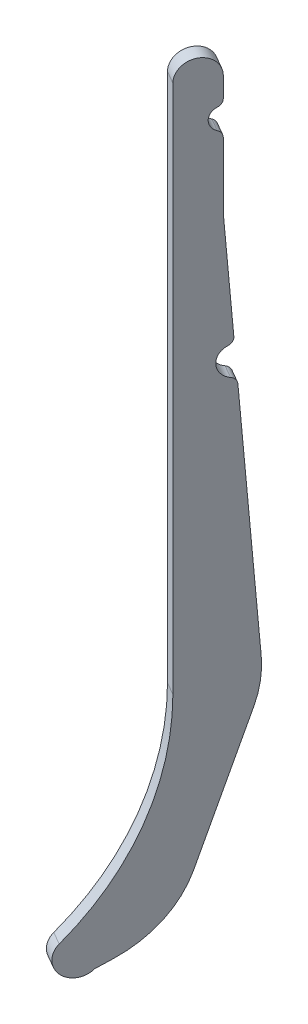
ISO-10303-21;
HEADER;
FILE_DESCRIPTION(('STEP AP214'),'2;1');
FILE_NAME('part.step','',(''),(''),'','','');
FILE_SCHEMA(('AUTOMOTIVE_DESIGN { 1 0 10303 214 1 1 1 1 }'));
ENDSEC;
DATA;
#1=APPLICATION_CONTEXT('core data for automotive mechanical design processes');
#2=APPLICATION_PROTOCOL_DEFINITION('international standard','automotive_design',2000,#1);
#3=PRODUCT_CONTEXT('',#1,'mechanical');
#4=PRODUCT('Part','Part','',(#3));
#5=PRODUCT_RELATED_PRODUCT_CATEGORY('part','',(#4));
#6=PRODUCT_DEFINITION_FORMATION('','',#4);
#7=PRODUCT_DEFINITION_CONTEXT('part definition',#1,'design');
#8=PRODUCT_DEFINITION('design','',#6,#7);
#9=PRODUCT_DEFINITION_SHAPE('','',#8);
#10=(LENGTH_UNIT() NAMED_UNIT(*) SI_UNIT(.MILLI.,.METRE.));
#11=(NAMED_UNIT(*) PLANE_ANGLE_UNIT() SI_UNIT($,.RADIAN.));
#12=(NAMED_UNIT(*) SI_UNIT($,.STERADIAN.) SOLID_ANGLE_UNIT());
#13=UNCERTAINTY_MEASURE_WITH_UNIT(LENGTH_MEASURE(1.E-05),#10,'distance_accuracy_value','');
#14=(GEOMETRIC_REPRESENTATION_CONTEXT(3) GLOBAL_UNCERTAINTY_ASSIGNED_CONTEXT((#13)) GLOBAL_UNIT_ASSIGNED_CONTEXT((#10,
#11,#12)) REPRESENTATION_CONTEXT('',''));
#15=CARTESIAN_POINT('',(0.,0.,0.));
#16=DIRECTION('',(0.,0.,1.));
#17=DIRECTION('',(1.,0.,0.));
#18=AXIS2_PLACEMENT_3D('',#15,#16,#17);
#19=CARTESIAN_POINT('',(-39.0363477362785,-207.116263928434,7.22466133764308));
#20=DIRECTION('',(0.866025403782537,0.,0.500000000003293));
#21=DIRECTION('',(0.500000000003293,0.,-0.866025403782537));
#22=AXIS2_PLACEMENT_3D('',#19,#20,#21);
#23=CYLINDRICAL_SURFACE('',#22,77.);
#24=CARTESIAN_POINT('',(-35.5722461211484,-207.116263928434,9.22466133765625));
#25=DIRECTION('',(-0.866025403782537,0.,-0.500000000003293));
#26=DIRECTION('',(-0.500000000003293,0.,0.866025403782537));
#27=AXIS2_PLACEMENT_3D('',#24,#25,#26);
#28=CIRCLE('',#27,77.);
#29=CARTESIAN_POINT('',(2.9277538791052,-207.116263928434,-57.4592947535991));
#30=VERTEX_POINT('',#29);
#31=CARTESIAN_POINT('',(-8.348635045287,-261.563486079798,-37.9280162108164));
#32=VERTEX_POINT('',#31);
#33=EDGE_CURVE('E192',#30,#32,#28,.T.);
#34=ORIENTED_EDGE('',*,*,#33,.F.);
#35=DIRECTION('',(0.866025403782537,0.,0.500000000003293));
#36=VECTOR('',#35,1.);
#37=CARTESIAN_POINT('',(-0.536347736024945,-207.116263928434,-59.4592947536123));
#38=LINE('',#37,#36);
#39=CARTESIAN_POINT('',(-0.536347736024945,-207.116263928434,-59.4592947536123));
#40=VERTEX_POINT('',#39);
#41=EDGE_CURVE('E11',#40,#30,#38,.T.);
#42=ORIENTED_EDGE('',*,*,#41,.F.);
#43=CARTESIAN_POINT('',(-39.0363477362785,-207.116263928434,7.22466133764308));
#44=DIRECTION('',(-0.866025403782537,0.,-0.500000000003293));
#45=DIRECTION('',(-0.500000000003293,0.,0.866025403782537));
#46=AXIS2_PLACEMENT_3D('',#43,#44,#45);
#47=CIRCLE('',#46,77.);
#48=CARTESIAN_POINT('',(-11.8127366604171,-261.563486079798,-39.9280162108296));
#49=VERTEX_POINT('',#48);
#50=EDGE_CURVE('E235',#40,#49,#47,.T.);
#51=ORIENTED_EDGE('',*,*,#50,.T.);
#52=DIRECTION('',(0.866025403782537,0.,0.500000000003293));
#53=VECTOR('',#52,1.);
#54=CARTESIAN_POINT('',(-11.8127366604171,-261.563486079798,-39.9280162108296));
#55=LINE('',#54,#53);
#56=EDGE_CURVE('E36',#49,#32,#55,.T.);
#57=ORIENTED_EDGE('',*,*,#56,.T.);
#58=EDGE_LOOP('',(#34,#42,#51,#57));
#59=FACE_BOUND('',#58,.T.);
#60=ADVANCED_FACE('F33',(#59),#23,.F.);
#61=CARTESIAN_POINT('',(-0.536347736024945,-207.116263928434,-59.4592947536123));
#62=DIRECTION('',(0.500000000003293,0.,-0.866025403782537));
#63=DIRECTION('',(-0.866025403782537,0.,-0.500000000003293));
#64=AXIS2_PLACEMENT_3D('',#61,#62,#63);
#65=PLANE('',#64);
#66=DIRECTION('',(0.,1.,0.));
#67=VECTOR('',#66,1.);
#68=CARTESIAN_POINT('',(2.9277538791052,-207.116263928434,-57.4592947535991));
#69=LINE('',#68,#67);
#70=CARTESIAN_POINT('',(2.9277538791052,-63.6684610881357,-57.4592947535991));
#71=VERTEX_POINT('',#70);
#72=EDGE_CURVE('E108',#30,#71,#69,.T.);
#73=ORIENTED_EDGE('',*,*,#72,.T.);
#74=DIRECTION('',(0.866025403782537,0.,0.500000000003293));
#75=VECTOR('',#74,1.);
#76=CARTESIAN_POINT('',(-0.536347736024945,-63.6684610881357,-59.4592947536123));
#77=LINE('',#76,#75);
#78=CARTESIAN_POINT('',(-0.536347736024945,-63.6684610881357,-59.4592947536123));
#79=VERTEX_POINT('',#78);
#80=EDGE_CURVE('E42',#79,#71,#77,.T.);
#81=ORIENTED_EDGE('',*,*,#80,.F.);
#82=DIRECTION('',(0.,1.,0.));
#83=VECTOR('',#82,1.);
#84=CARTESIAN_POINT('',(-0.536347736024945,-207.116263928434,-59.4592947536123));
#85=LINE('',#84,#83);
#86=EDGE_CURVE('E171',#40,#79,#85,.T.);
#87=ORIENTED_EDGE('',*,*,#86,.F.);
#88=ORIENTED_EDGE('',*,*,#41,.T.);
#89=EDGE_LOOP('',(#73,#81,#87,#88));
#90=FACE_BOUND('',#89,.T.);
#91=ADVANCED_FACE('F368',(#90),#65,.F.);
#92=CARTESIAN_POINT('',(1.96365226399152,-63.6684610881357,-63.789421772525));
#93=DIRECTION('',(0.866025403782537,0.,0.500000000003293));
#94=DIRECTION('',(0.500000000003293,0.,-0.866025403782537));
#95=AXIS2_PLACEMENT_3D('',#92,#93,#94);
#96=CYLINDRICAL_SURFACE('',#95,5.);
#97=CARTESIAN_POINT('',(5.42775387912167,-63.6684610881357,-61.7894217725118));
#98=DIRECTION('',(-0.866025403782537,0.,-0.500000000003293));
#99=DIRECTION('',(-0.500000000003293,0.,0.866025403782537));
#100=AXIS2_PLACEMENT_3D('',#97,#98,#99);
#101=CIRCLE('',#100,5.);
#102=CARTESIAN_POINT('',(7.92775387913814,-63.6684610881357,-66.1195487914245));
#103=VERTEX_POINT('',#102);
#104=EDGE_CURVE('E178',#71,#103,#101,.T.);
#105=ORIENTED_EDGE('',*,*,#104,.T.);
#106=DIRECTION('',(0.866025403782537,0.,0.500000000003293));
#107=VECTOR('',#106,1.);
#108=CARTESIAN_POINT('',(4.46365226400799,-63.6684610881357,-68.1195487914377));
#109=LINE('',#108,#107);
#110=CARTESIAN_POINT('',(4.46365226400799,-63.6684610881357,-68.1195487914377));
#111=VERTEX_POINT('',#110);
#112=EDGE_CURVE('E175',#111,#103,#109,.T.);
#113=ORIENTED_EDGE('',*,*,#112,.F.);
#114=CARTESIAN_POINT('',(1.96365226399152,-63.6684610881357,-63.789421772525));
#115=DIRECTION('',(-0.866025403782537,0.,-0.500000000003293));
#116=DIRECTION('',(-0.500000000003293,0.,0.866025403782537));
#117=AXIS2_PLACEMENT_3D('',#114,#115,#116);
#118=CIRCLE('',#117,5.);
#119=EDGE_CURVE('E163',#79,#111,#118,.T.);
#120=ORIENTED_EDGE('',*,*,#119,.F.);
#121=ORIENTED_EDGE('',*,*,#80,.T.);
#122=EDGE_LOOP('',(#105,#113,#120,#121));
#123=FACE_BOUND('',#122,.T.);
#124=ADVANCED_FACE('F176',(#123),#96,.T.);
#125=CARTESIAN_POINT('',(4.46365226400799,-69.0858853931799,-68.1195487914377));
#126=DIRECTION('',(0.500000000003293,0.,-0.866025403782537));
#127=DIRECTION('',(-0.866025403782537,0.,-0.500000000003293));
#128=AXIS2_PLACEMENT_3D('',#125,#126,#127);
#129=PLANE('',#128);
#130=DIRECTION('',(0.,1.,0.));
#131=VECTOR('',#130,1.);
#132=CARTESIAN_POINT('',(7.92775387913814,-69.0858853931799,-66.1195487914245));
#133=LINE('',#132,#131);
#134=CARTESIAN_POINT('',(7.92775387913814,-69.0858853931799,-66.1195487914245));
#135=VERTEX_POINT('',#134);
#136=EDGE_CURVE('E232',#135,#103,#133,.T.);
#137=ORIENTED_EDGE('',*,*,#136,.F.);
#138=DIRECTION('',(0.866025403782537,0.,0.500000000003293));
#139=VECTOR('',#138,1.);
#140=CARTESIAN_POINT('',(4.46365226400799,-69.0858853931799,-68.1195487914377));
#141=LINE('',#140,#139);
#142=CARTESIAN_POINT('',(4.46365226400799,-69.0858853931799,-68.1195487914377));
#143=VERTEX_POINT('',#142);
#144=EDGE_CURVE('E182',#143,#135,#141,.T.);
#145=ORIENTED_EDGE('',*,*,#144,.F.);
#146=DIRECTION('',(0.,1.,0.));
#147=VECTOR('',#146,1.);
#148=CARTESIAN_POINT('',(4.46365226400799,-69.0858853931799,-68.1195487914377));
#149=LINE('',#148,#147);
#150=EDGE_CURVE('E169',#143,#111,#149,.T.);
#151=ORIENTED_EDGE('',*,*,#150,.T.);
#152=ORIENTED_EDGE('',*,*,#112,.T.);
#153=EDGE_LOOP('',(#137,#145,#151,#152));
#154=FACE_BOUND('',#153,.T.);
#155=ADVANCED_FACE('F184',(#154),#129,.T.);
#156=CARTESIAN_POINT('',(3.46365226400139,-69.0858853931799,-66.3874979838726));
#157=DIRECTION('',(0.866025403782537,0.,0.500000000003293));
#158=DIRECTION('',(0.500000000003293,0.,-0.866025403782537));
#159=AXIS2_PLACEMENT_3D('',#156,#157,#158);
#160=CYLINDRICAL_SURFACE('',#159,2.);
#161=CARTESIAN_POINT('',(6.92775387913154,-69.0858853931799,-64.3874979838594));
#162=DIRECTION('',(0.866025403782537,0.,0.500000000003293));
#163=DIRECTION('',(0.500000000003293,0.,-0.866025403782537));
#164=AXIS2_PLACEMENT_3D('',#161,#162,#163);
#165=CIRCLE('',#164,2.);
#166=CARTESIAN_POINT('',(7.32775387913418,-70.9189156711622,-65.0803183068855));
#167=VERTEX_POINT('',#166);
#168=EDGE_CURVE('E229',#167,#135,#165,.T.);
#169=ORIENTED_EDGE('',*,*,#168,.F.);
#170=DIRECTION('',(0.866025403782537,0.,0.500000000003293));
#171=VECTOR('',#170,1.);
#172=CARTESIAN_POINT('',(3.86365226400403,-70.9189156711622,-67.0803183068986));
#173=LINE('',#172,#171);
#174=CARTESIAN_POINT('',(3.86365226400403,-70.9189156711622,-67.0803183068986));
#175=VERTEX_POINT('',#174);
#176=EDGE_CURVE('E239',#175,#167,#173,.T.);
#177=ORIENTED_EDGE('',*,*,#176,.F.);
#178=CARTESIAN_POINT('',(3.46365226400139,-69.0858853931799,-66.3874979838726));
#179=DIRECTION('',(0.866025403782537,0.,0.500000000003293));
#180=DIRECTION('',(0.500000000003293,0.,-0.866025403782537));
#181=AXIS2_PLACEMENT_3D('',#178,#179,#180);
#182=CIRCLE('',#181,2.);
#183=EDGE_CURVE('E185',#175,#143,#182,.T.);
#184=ORIENTED_EDGE('',*,*,#183,.T.);
#185=ORIENTED_EDGE('',*,*,#144,.T.);
#186=EDGE_LOOP('',(#169,#177,#184,#185));
#187=FACE_BOUND('',#186,.T.);
#188=ADVANCED_FACE('F277',(#187),#160,.T.);
#189=CARTESIAN_POINT('',(4.46365226400798,-73.6684610881357,-68.1195487914377));
#190=DIRECTION('',(0.866025403782537,0.,0.500000000003293));
#191=DIRECTION('',(0.500000000003293,0.,-0.866025403782537));
#192=AXIS2_PLACEMENT_3D('',#189,#190,#191);
#193=CYLINDRICAL_SURFACE('',#192,3.);
#194=CARTESIAN_POINT('',(7.92775387913813,-73.6684610881357,-66.1195487914245));
#195=DIRECTION('',(-0.866025403782537,0.,-0.500000000003293));
#196=DIRECTION('',(-0.500000000003293,0.,0.866025403782537));
#197=AXIS2_PLACEMENT_3D('',#194,#195,#196);
#198=CIRCLE('',#197,3.);
#199=CARTESIAN_POINT('',(7.32775387913418,-76.4180065051092,-65.0803183068855));
#200=VERTEX_POINT('',#199);
#201=EDGE_CURVE('E226',#200,#167,#198,.T.);
#202=ORIENTED_EDGE('',*,*,#201,.F.);
#203=DIRECTION('',(0.866025403782537,0.,0.500000000003293));
#204=VECTOR('',#203,1.);
#205=CARTESIAN_POINT('',(3.86365226400403,-76.4180065051092,-67.0803183068986));
#206=LINE('',#205,#204);
#207=CARTESIAN_POINT('',(3.86365226400403,-76.4180065051092,-67.0803183068986));
#208=VERTEX_POINT('',#207);
#209=EDGE_CURVE('E241',#208,#200,#206,.T.);
#210=ORIENTED_EDGE('',*,*,#209,.F.);
#211=CARTESIAN_POINT('',(4.46365226400798,-73.6684610881357,-68.1195487914377));
#212=DIRECTION('',(-0.866025403782537,0.,-0.500000000003293));
#213=DIRECTION('',(-0.500000000003293,0.,0.866025403782537));
#214=AXIS2_PLACEMENT_3D('',#211,#212,#213);
#215=CIRCLE('',#214,3.);
#216=EDGE_CURVE('E187',#208,#175,#215,.T.);
#217=ORIENTED_EDGE('',*,*,#216,.T.);
#218=ORIENTED_EDGE('',*,*,#176,.T.);
#219=EDGE_LOOP('',(#202,#210,#217,#218));
#220=FACE_BOUND('',#219,.T.);
#221=ADVANCED_FACE('F281',(#220),#193,.F.);
#222=CARTESIAN_POINT('',(3.46365226400139,-78.2510367830915,-66.3874979838726));
#223=DIRECTION('',(0.866025403782537,0.,0.500000000003293));
#224=DIRECTION('',(0.500000000003293,0.,-0.866025403782537));
#225=AXIS2_PLACEMENT_3D('',#222,#223,#224);
#226=CYLINDRICAL_SURFACE('',#225,2.);
#227=CARTESIAN_POINT('',(6.92775387913154,-78.2510367830915,-64.3874979838594));
#228=DIRECTION('',(-0.866025403782537,0.,-0.500000000003293));
#229=DIRECTION('',(-0.500000000003293,0.,0.866025403782537));
#230=AXIS2_PLACEMENT_3D('',#227,#228,#229);
#231=CIRCLE('',#230,2.);
#232=CARTESIAN_POINT('',(7.92775387913813,-78.2510367830915,-66.1195487914245));
#233=VERTEX_POINT('',#232);
#234=EDGE_CURVE('E223',#200,#233,#231,.T.);
#235=ORIENTED_EDGE('',*,*,#234,.T.);
#236=DIRECTION('',(0.866025403782537,0.,0.500000000003293));
#237=VECTOR('',#236,1.);
#238=CARTESIAN_POINT('',(4.46365226400798,-78.2510367830915,-68.1195487914377));
#239=LINE('',#238,#237);
#240=CARTESIAN_POINT('',(4.46365226400798,-78.2510367830915,-68.1195487914377));
#241=VERTEX_POINT('',#240);
#242=EDGE_CURVE('E243',#241,#233,#239,.T.);
#243=ORIENTED_EDGE('',*,*,#242,.F.);
#244=CARTESIAN_POINT('',(3.46365226400139,-78.2510367830915,-66.3874979838726));
#245=DIRECTION('',(-0.866025403782537,0.,-0.500000000003293));
#246=DIRECTION('',(-0.500000000003293,0.,0.866025403782537));
#247=AXIS2_PLACEMENT_3D('',#244,#245,#246);
#248=CIRCLE('',#247,2.);
#249=EDGE_CURVE('E283',#208,#241,#248,.T.);
#250=ORIENTED_EDGE('',*,*,#249,.F.);
#251=ORIENTED_EDGE('',*,*,#209,.T.);
#252=EDGE_LOOP('',(#235,#243,#250,#251));
#253=FACE_BOUND('',#252,.T.);
#254=ADVANCED_FACE('F358',(#253),#226,.T.);
#255=CARTESIAN_POINT('',(4.46365226400799,-96.0501889482241,-68.1195487914377));
#256=DIRECTION('',(0.500000000003293,0.,-0.866025403782537));
#257=DIRECTION('',(-0.866025403782537,0.,-0.500000000003293));
#258=AXIS2_PLACEMENT_3D('',#255,#256,#257);
#259=PLANE('',#258);
#260=DIRECTION('',(0.,1.,0.));
#261=VECTOR('',#260,1.);
#262=CARTESIAN_POINT('',(7.92775387913814,-96.0501889482241,-66.1195487914245));
#263=LINE('',#262,#261);
#264=CARTESIAN_POINT('',(7.92775387913814,-96.0501889482241,-66.1195487914245));
#265=VERTEX_POINT('',#264);
#266=EDGE_CURVE('E220',#265,#233,#263,.T.);
#267=ORIENTED_EDGE('',*,*,#266,.F.);
#268=DIRECTION('',(0.866025403782537,0.,0.500000000003293));
#269=VECTOR('',#268,1.);
#270=CARTESIAN_POINT('',(4.46365226400799,-96.0501889482241,-68.1195487914377));
#271=LINE('',#270,#269);
#272=CARTESIAN_POINT('',(4.46365226400799,-96.0501889482241,-68.1195487914377));
#273=VERTEX_POINT('',#272);
#274=EDGE_CURVE('E245',#273,#265,#271,.T.);
#275=ORIENTED_EDGE('',*,*,#274,.F.);
#276=DIRECTION('',(0.,1.,0.));
#277=VECTOR('',#276,1.);
#278=CARTESIAN_POINT('',(4.46365226400799,-96.0501889482241,-68.1195487914377));
#279=LINE('',#278,#277);
#280=EDGE_CURVE('E284',#273,#241,#279,.T.);
#281=ORIENTED_EDGE('',*,*,#280,.T.);
#282=ORIENTED_EDGE('',*,*,#242,.T.);
#283=EDGE_LOOP('',(#267,#275,#281,#282));
#284=FACE_BOUND('',#283,.T.);
#285=ADVANCED_FACE('F355',(#284),#259,.T.);
#286=CARTESIAN_POINT('',(4.46365226400799,-96.0501889482241,-68.1195487914377));
#287=DIRECTION('',(-0.498726456811667,-0.0713280107491375,0.863819562269026));
#288=DIRECTION('',(0.866025403782537,0.,0.500000000003293));
#289=AXIS2_PLACEMENT_3D('',#286,#287,#288);
#290=PLANE('',#289);
#291=DIRECTION('',(0.0356640053748036,-0.997452913616764,-0.061771869310027));
#292=VECTOR('',#291,1.);
#293=CARTESIAN_POINT('',(7.92775387913814,-96.0501889482241,-66.1195487914245));
#294=LINE('',#293,#292);
#295=CARTESIAN_POINT('',(8.97424798689789,-125.318595171749,-67.9321297558699));
#296=VERTEX_POINT('',#295);
#297=EDGE_CURVE('E217',#265,#296,#294,.T.);
#298=ORIENTED_EDGE('',*,*,#297,.T.);
#299=DIRECTION('',(0.866025403782537,0.,0.500000000003293));
#300=VECTOR('',#299,1.);
#301=CARTESIAN_POINT('',(5.51014637176774,-125.318595171749,-69.9321297558831));
#302=LINE('',#301,#300);
#303=CARTESIAN_POINT('',(5.51014637176774,-125.318595171749,-69.9321297558831));
#304=VERTEX_POINT('',#303);
#305=EDGE_CURVE('E247',#304,#296,#302,.T.);
#306=ORIENTED_EDGE('',*,*,#305,.F.);
#307=DIRECTION('',(0.0356640053748036,-0.997452913616764,-0.061771869310027));
#308=VECTOR('',#307,1.);
#309=CARTESIAN_POINT('',(4.46365226400799,-96.0501889482241,-68.1195487914377));
#310=LINE('',#309,#308);
#311=EDGE_CURVE('E289',#273,#304,#310,.T.);
#312=ORIENTED_EDGE('',*,*,#311,.F.);
#313=ORIENTED_EDGE('',*,*,#274,.T.);
#314=EDGE_LOOP('',(#298,#306,#312,#313));
#315=FACE_BOUND('',#314,.T.);
#316=ADVANCED_FACE('F352',(#315),#290,.F.);
#317=CARTESIAN_POINT('',(4.51269345814441,-125.461251193248,-68.2044906313451));
#318=DIRECTION('',(0.866025403782537,0.,0.500000000003293));
#319=DIRECTION('',(0.500000000003293,0.,-0.866025403782537));
#320=AXIS2_PLACEMENT_3D('',#317,#318,#319);
#321=CYLINDRICAL_SURFACE('',#320,2.);
#322=CARTESIAN_POINT('',(7.97679507327455,-125.461251193248,-66.2044906313319));
#323=DIRECTION('',(0.866025403782537,0.,0.500000000003293));
#324=DIRECTION('',(0.500000000003293,0.,-0.866025403782537));
#325=AXIS2_PLACEMENT_3D('',#322,#323,#324);
#326=CIRCLE('',#325,2.);
#327=CARTESIAN_POINT('',(8.37652807126847,-127.294514437102,-66.8968484933131));
#328=VERTEX_POINT('',#327);
#329=EDGE_CURVE('E214',#328,#296,#326,.T.);
#330=ORIENTED_EDGE('',*,*,#329,.F.);
#331=DIRECTION('',(0.866025403782537,0.,0.500000000003293));
#332=VECTOR('',#331,1.);
#333=CARTESIAN_POINT('',(4.91242645613832,-127.294514437102,-68.8968484933262));
#334=LINE('',#333,#332);
#335=CARTESIAN_POINT('',(4.91242645613832,-127.294514437102,-68.8968484933262));
#336=VERTEX_POINT('',#335);
#337=EDGE_CURVE('E249',#336,#328,#334,.T.);
#338=ORIENTED_EDGE('',*,*,#337,.F.);
#339=CARTESIAN_POINT('',(4.51269345814441,-125.461251193248,-68.2044906313451));
#340=DIRECTION('',(0.866025403782537,0.,0.500000000003293));
#341=DIRECTION('',(0.500000000003293,0.,-0.866025403782537));
#342=AXIS2_PLACEMENT_3D('',#339,#340,#341);
#343=CIRCLE('',#342,2.);
#344=EDGE_CURVE('E291',#336,#304,#343,.T.);
#345=ORIENTED_EDGE('',*,*,#344,.T.);
#346=ORIENTED_EDGE('',*,*,#305,.T.);
#347=EDGE_LOOP('',(#330,#338,#345,#346));
#348=FACE_BOUND('',#347,.T.);
#349=ADVANCED_FACE('F347',(#348),#321,.T.);
#350=CARTESIAN_POINT('',(5.71189245212612,-130.961040924811,-70.2815642172886));
#351=DIRECTION('',(0.866025403782537,0.,0.500000000003293));
#352=DIRECTION('',(0.500000000003293,0.,-0.866025403782537));
#353=AXIS2_PLACEMENT_3D('',#350,#351,#352);
#354=CYLINDRICAL_SURFACE('',#353,4.);
#355=CARTESIAN_POINT('',(9.17599406725627,-130.961040924811,-68.2815642172755));
#356=DIRECTION('',(-0.866025403782537,0.,-0.500000000003293));
#357=DIRECTION('',(-0.500000000003293,0.,0.866025403782537));
#358=AXIS2_PLACEMENT_3D('',#355,#356,#357);
#359=CIRCLE('',#358,4.);
#360=CARTESIAN_POINT('',(8.64552284507961,-134.817775441184,-67.3627611085204));
#361=VERTEX_POINT('',#360);
#362=EDGE_CURVE('E211',#361,#328,#359,.T.);
#363=ORIENTED_EDGE('',*,*,#362,.F.);
#364=DIRECTION('',(0.866025403782537,0.,0.500000000003293));
#365=VECTOR('',#364,1.);
#366=CARTESIAN_POINT('',(5.18142122994947,-134.817775441184,-69.3627611085336));
#367=LINE('',#366,#365);
#368=CARTESIAN_POINT('',(5.18142122994947,-134.817775441184,-69.3627611085336));
#369=VERTEX_POINT('',#368);
#370=EDGE_CURVE('E251',#369,#361,#367,.T.);
#371=ORIENTED_EDGE('',*,*,#370,.F.);
#372=CARTESIAN_POINT('',(5.71189245212612,-130.961040924811,-70.2815642172886));
#373=DIRECTION('',(-0.866025403782537,0.,-0.500000000003293));
#374=DIRECTION('',(-0.500000000003293,0.,0.866025403782537));
#375=AXIS2_PLACEMENT_3D('',#372,#373,#374);
#376=CIRCLE('',#375,4.);
#377=EDGE_CURVE('E294',#369,#336,#376,.T.);
#378=ORIENTED_EDGE('',*,*,#377,.T.);
#379=ORIENTED_EDGE('',*,*,#337,.T.);
#380=EDGE_LOOP('',(#363,#371,#378,#379));
#381=FACE_BOUND('',#380,.T.);
#382=ADVANCED_FACE('F342',(#381),#354,.F.);
#383=CARTESIAN_POINT('',(4.91618561886116,-136.746142699371,-68.9033595541561));
#384=DIRECTION('',(0.866025403782537,0.,0.500000000003293));
#385=DIRECTION('',(0.500000000003293,0.,-0.866025403782537));
#386=AXIS2_PLACEMENT_3D('',#383,#384,#385);
#387=CYLINDRICAL_SURFACE('',#386,2.);
#388=CARTESIAN_POINT('',(8.38028723399131,-136.746142699371,-66.9033595541429));
#389=DIRECTION('',(-0.866025403782537,0.,-0.500000000003293));
#390=DIRECTION('',(-0.500000000003293,0.,0.866025403782537));
#391=AXIS2_PLACEMENT_3D('',#388,#389,#390);
#392=CIRCLE('',#391,2.);
#393=CARTESIAN_POINT('',(9.37774014761464,-136.603486677872,-68.630998678681));
#394=VERTEX_POINT('',#393);
#395=EDGE_CURVE('E209',#361,#394,#392,.T.);
#396=ORIENTED_EDGE('',*,*,#395,.T.);
#397=DIRECTION('',(0.866025403782537,0.,0.500000000003293));
#398=VECTOR('',#397,1.);
#399=CARTESIAN_POINT('',(5.91363853248449,-136.603486677872,-70.6309986786941));
#400=LINE('',#399,#398);
#401=CARTESIAN_POINT('',(5.91363853248449,-136.603486677872,-70.6309986786941));
#402=VERTEX_POINT('',#401);
#403=EDGE_CURVE('E253',#402,#394,#400,.T.);
#404=ORIENTED_EDGE('',*,*,#403,.F.);
#405=CARTESIAN_POINT('',(4.91618561886116,-136.746142699371,-68.9033595541561));
#406=DIRECTION('',(-0.866025403782537,0.,-0.500000000003293));
#407=DIRECTION('',(-0.500000000003293,0.,0.866025403782537));
#408=AXIS2_PLACEMENT_3D('',#405,#406,#407);
#409=CIRCLE('',#408,2.);
#410=EDGE_CURVE('E297',#369,#402,#409,.T.);
#411=ORIENTED_EDGE('',*,*,#410,.F.);
#412=ORIENTED_EDGE('',*,*,#370,.T.);
#413=EDGE_LOOP('',(#396,#404,#411,#412));
#414=FACE_BOUND('',#413,.T.);
#415=ADVANCED_FACE('F339',(#414),#387,.T.);
#416=CARTESIAN_POINT('',(5.91363853248449,-136.603486677872,-70.6309986786941));
#417=DIRECTION('',(-0.498726456811667,-0.0713280107491381,0.863819562269026));
#418=DIRECTION('',(0.866025403782537,0.,0.500000000003293));
#419=AXIS2_PLACEMENT_3D('',#416,#417,#418);
#420=PLANE('',#419);
#421=DIRECTION('',(0.035664005374804,-0.997452913616763,-0.0617718693100274));
#422=VECTOR('',#421,1.);
#423=CARTESIAN_POINT('',(9.37774014761464,-136.603486677872,-68.630998678681));
#424=LINE('',#423,#422);
#425=CARTESIAN_POINT('',(11.6877667870702,-201.210442005586,-72.6320821850205));
#426=VERTEX_POINT('',#425);
#427=EDGE_CURVE('E207',#394,#426,#424,.T.);
#428=ORIENTED_EDGE('',*,*,#427,.T.);
#429=DIRECTION('',(0.866025403782537,0.,0.500000000003293));
#430=VECTOR('',#429,1.);
#431=CARTESIAN_POINT('',(8.22366517194008,-201.210442005586,-74.6320821850337));
#432=LINE('',#431,#430);
#433=CARTESIAN_POINT('',(8.22366517194008,-201.210442005586,-74.6320821850337));
#434=VERTEX_POINT('',#433);
#435=EDGE_CURVE('E256',#434,#426,#432,.T.);
#436=ORIENTED_EDGE('',*,*,#435,.F.);
#437=DIRECTION('',(0.035664005374804,-0.997452913616763,-0.0617718693100274));
#438=VECTOR('',#437,1.);
#439=CARTESIAN_POINT('',(5.91363853248449,-136.603486677872,-70.6309986786941));
#440=LINE('',#439,#438);
#441=EDGE_CURVE('E299',#402,#434,#440,.T.);
#442=ORIENTED_EDGE('',*,*,#441,.F.);
#443=ORIENTED_EDGE('',*,*,#403,.T.);
#444=EDGE_LOOP('',(#428,#436,#442,#443));
#445=FACE_BOUND('',#444,.T.);
#446=ADVANCED_FACE('F334',(#445),#420,.F.);
#447=CARTESIAN_POINT('',(-6.73812853240992,-203.350282328061,-48.7174953169629));
#448=DIRECTION('',(0.866025403782537,0.,0.500000000003293));
#449=DIRECTION('',(0.500000000003293,0.,-0.866025403782537));
#450=AXIS2_PLACEMENT_3D('',#447,#448,#449);
#451=CYLINDRICAL_SURFACE('',#450,30.);
#452=CARTESIAN_POINT('',(-3.27402691727977,-203.350282328061,-46.7174953169497));
#453=DIRECTION('',(-0.866025403782537,0.,-0.500000000003293));
#454=DIRECTION('',(-0.500000000003293,0.,0.866025403782537));
#455=AXIS2_PLACEMENT_3D('',#452,#453,#454);
#456=CIRCLE('',#455,30.);
#457=CARTESIAN_POINT('',(10.9723662458005,-212.739698038447,-71.3929720997899));
#458=VERTEX_POINT('',#457);
#459=EDGE_CURVE('E205',#426,#458,#456,.T.);
#460=ORIENTED_EDGE('',*,*,#459,.T.);
#461=DIRECTION('',(0.866025403782537,0.,0.500000000003293));
#462=VECTOR('',#461,1.);
#463=CARTESIAN_POINT('',(7.50826463067035,-212.739698038447,-73.3929720998031));
#464=LINE('',#463,#462);
#465=CARTESIAN_POINT('',(7.50826463067035,-212.739698038447,-73.3929720998031));
#466=VERTEX_POINT('',#465);
#467=EDGE_CURVE('E259',#466,#458,#464,.T.);
#468=ORIENTED_EDGE('',*,*,#467,.F.);
#469=CARTESIAN_POINT('',(-6.73812853240992,-203.350282328061,-48.7174953169629));
#470=DIRECTION('',(-0.866025403782537,0.,-0.500000000003293));
#471=DIRECTION('',(-0.500000000003293,0.,0.866025403782537));
#472=AXIS2_PLACEMENT_3D('',#469,#470,#471);
#473=CIRCLE('',#472,30.);
#474=EDGE_CURVE('E301',#434,#466,#473,.T.);
#475=ORIENTED_EDGE('',*,*,#474,.F.);
#476=ORIENTED_EDGE('',*,*,#435,.T.);
#477=EDGE_LOOP('',(#460,#468,#475,#476));
#478=FACE_BOUND('',#477,.T.);
#479=ADVANCED_FACE('F328',(#478),#451,.T.);
#480=CARTESIAN_POINT('',(7.50826463067035,-212.739698038447,-73.3929720998031));
#481=DIRECTION('',(-0.474879772102676,0.312980523679548,0.822515892761341));
#482=DIRECTION('',(0.866025403782537,0.,0.500000000003293));
#483=AXIS2_PLACEMENT_3D('',#480,#481,#482);
#484=PLANE('',#483);
#485=DIRECTION('',(-0.156490261840805,-0.949759544199097,0.27104908439565));
#486=VECTOR('',#485,1.);
#487=CARTESIAN_POINT('',(10.9723662458005,-212.739698038447,-71.3929720997899));
#488=LINE('',#487,#486);
#489=CARTESIAN_POINT('',(4.97946190043002,-249.111405980747,-61.0129572887991));
#490=VERTEX_POINT('',#489);
#491=EDGE_CURVE('E203',#458,#490,#488,.T.);
#492=ORIENTED_EDGE('',*,*,#491,.T.);
#493=DIRECTION('',(0.866025403782537,0.,0.500000000003293));
#494=VECTOR('',#493,1.);
#495=CARTESIAN_POINT('',(1.51536028529987,-249.111405980747,-63.0129572888123));
#496=LINE('',#495,#494);
#497=CARTESIAN_POINT('',(1.51536028529987,-249.111405980747,-63.0129572888123));
#498=VERTEX_POINT('',#497);
#499=EDGE_CURVE('E262',#498,#490,#496,.T.);
#500=ORIENTED_EDGE('',*,*,#499,.F.);
#501=DIRECTION('',(-0.156490261840805,-0.949759544199097,0.27104908439565));
#502=VECTOR('',#501,1.);
#503=CARTESIAN_POINT('',(7.50826463067035,-212.739698038447,-73.3929720998031));
#504=LINE('',#503,#502);
#505=EDGE_CURVE('E303',#466,#498,#504,.T.);
#506=ORIENTED_EDGE('',*,*,#505,.F.);
#507=ORIENTED_EDGE('',*,*,#467,.T.);
#508=EDGE_LOOP('',(#492,#500,#506,#507));
#509=FACE_BOUND('',#508,.T.);
#510=ADVANCED_FACE('F324',(#509),#484,.F.);
#511=CARTESIAN_POINT('',(-12.7310328777804,-239.721990270361,-38.337480505972));
#512=DIRECTION('',(0.866025403782537,0.,0.500000000003293));
#513=DIRECTION('',(0.500000000003293,0.,-0.866025403782537));
#514=AXIS2_PLACEMENT_3D('',#511,#512,#513);
#515=CYLINDRICAL_SURFACE('',#514,30.);
#516=CARTESIAN_POINT('',(-9.26693126265028,-239.721990270361,-36.3374805059589));
#517=DIRECTION('',(-0.866025403782537,0.,-0.500000000003293));
#518=DIRECTION('',(-0.500000000003293,0.,0.866025403782537));
#519=AXIS2_PLACEMENT_3D('',#516,#517,#518);
#520=CIRCLE('',#519,30.);
#521=CARTESIAN_POINT('',(-3.03511704949219,-267.01041210917,-47.1312993463837));
#522=VERTEX_POINT('',#521);
#523=EDGE_CURVE('E201',#490,#522,#520,.T.);
#524=ORIENTED_EDGE('',*,*,#523,.T.);
#525=DIRECTION('',(0.866025403782537,0.,0.500000000003293));
#526=VECTOR('',#525,1.);
#527=CARTESIAN_POINT('',(-6.49921866462234,-267.01041210917,-49.1312993463969));
#528=LINE('',#527,#526);
#529=CARTESIAN_POINT('',(-6.49921866462234,-267.01041210917,-49.1312993463969));
#530=VERTEX_POINT('',#529);
#531=EDGE_CURVE('E265',#530,#522,#528,.T.);
#532=ORIENTED_EDGE('',*,*,#531,.F.);
#533=CARTESIAN_POINT('',(-12.7310328777804,-239.721990270361,-38.337480505972));
#534=DIRECTION('',(-0.866025403782537,0.,-0.500000000003293));
#535=DIRECTION('',(-0.500000000003293,0.,0.866025403782537));
#536=AXIS2_PLACEMENT_3D('',#533,#534,#535);
#537=CIRCLE('',#536,30.);
#538=EDGE_CURVE('E305',#498,#530,#537,.T.);
#539=ORIENTED_EDGE('',*,*,#538,.F.);
#540=ORIENTED_EDGE('',*,*,#499,.T.);
#541=EDGE_LOOP('',(#524,#532,#539,#540));
#542=FACE_BOUND('',#541,.T.);
#543=ADVANCED_FACE('F320',(#542),#515,.T.);
#544=CARTESIAN_POINT('',(-6.49921866462235,-267.01041210917,-49.1312993463969));
#545=DIRECTION('',(-0.207727140438606,0.909614061293619,0.359793961347502));
#546=DIRECTION('',(0.,-0.367817228462184,0.929898105410694));
#547=AXIS2_PLACEMENT_3D('',#544,#545,#546);
#548=PLANE('',#547);
#549=DIRECTION('',(-0.454807030649806,-0.415454280874476,0.78774888471808));
#550=VECTOR('',#549,1.);
#551=CARTESIAN_POINT('',(-3.0351170494922,-267.01041210917,-47.1312993463837));
#552=LINE('',#551,#550);
#553=CARTESIAN_POINT('',(-4.81310113933096,-268.634553891663,-44.0517405677609));
#554=VERTEX_POINT('',#553);
#555=EDGE_CURVE('E198',#522,#554,#552,.T.);
#556=ORIENTED_EDGE('',*,*,#555,.T.);
#557=DIRECTION('',(0.866025403782537,0.,0.500000000003293));
#558=VECTOR('',#557,1.);
#559=CARTESIAN_POINT('',(-8.27720275446111,-268.634553891663,-46.0517405677741));
#560=LINE('',#559,#558);
#561=CARTESIAN_POINT('',(-8.27720275446111,-268.634553891663,-46.0517405677741));
#562=VERTEX_POINT('',#561);
#563=EDGE_CURVE('E267',#562,#554,#560,.T.);
#564=ORIENTED_EDGE('',*,*,#563,.F.);
#565=DIRECTION('',(-0.454807030649806,-0.415454280874476,0.78774888471808));
#566=VECTOR('',#565,1.);
#567=CARTESIAN_POINT('',(-6.49921866462235,-267.01041210917,-49.1312993463969));
#568=LINE('',#567,#566);
#569=EDGE_CURVE('E307',#530,#562,#568,.T.);
#570=ORIENTED_EDGE('',*,*,#569,.F.);
#571=ORIENTED_EDGE('',*,*,#531,.T.);
#572=EDGE_LOOP('',(#556,#564,#570,#571));
#573=FACE_BOUND('',#572,.T.);
#574=ADVANCED_FACE('F315',(#573),#548,.F.);
#575=CARTESIAN_POINT('',(-10.0449697074391,-265.099019985731,-42.9898783893019));
#576=DIRECTION('',(0.866025403782537,0.,0.500000000003293));
#577=DIRECTION('',(0.500000000003293,0.,-0.866025403782537));
#578=AXIS2_PLACEMENT_3D('',#575,#576,#577);
#579=CYLINDRICAL_SURFACE('',#578,5.);
#580=CARTESIAN_POINT('',(-6.58086809230897,-265.099019985731,-40.9898783892887));
#581=DIRECTION('',(0.866025403782537,0.,0.500000000003293));
#582=DIRECTION('',(0.500000000003293,0.,-0.866025403782537));
#583=AXIS2_PLACEMENT_3D('',#580,#581,#582);
#584=CIRCLE('',#583,5.);
#585=EDGE_CURVE('E195',#32,#554,#584,.T.);
#586=ORIENTED_EDGE('',*,*,#585,.F.);
#587=ORIENTED_EDGE('',*,*,#56,.F.);
#588=CARTESIAN_POINT('',(-10.0449697074391,-265.099019985731,-42.9898783893019));
#589=DIRECTION('',(0.866025403782537,0.,0.500000000003293));
#590=DIRECTION('',(0.500000000003293,0.,-0.866025403782537));
#591=AXIS2_PLACEMENT_3D('',#588,#589,#590);
#592=CIRCLE('',#591,5.);
#593=EDGE_CURVE('E309',#49,#562,#592,.T.);
#594=ORIENTED_EDGE('',*,*,#593,.T.);
#595=ORIENTED_EDGE('',*,*,#563,.T.);
#596=EDGE_LOOP('',(#586,#587,#594,#595));
#597=FACE_BOUND('',#596,.T.);
#598=ADVANCED_FACE('F269',(#597),#579,.T.);
#599=CARTESIAN_POINT('',(-39.0363477362785,-207.116263928434,7.22466133764308));
#600=DIRECTION('',(-0.866025403782537,0.,-0.500000000003293));
#601=DIRECTION('',(-0.500000000003293,0.,0.866025403782537));
#602=AXIS2_PLACEMENT_3D('',#599,#600,#601);
#603=PLANE('',#602);
#604=ORIENTED_EDGE('',*,*,#50,.F.);
#605=ORIENTED_EDGE('',*,*,#86,.T.);
#606=ORIENTED_EDGE('',*,*,#119,.T.);
#607=ORIENTED_EDGE('',*,*,#150,.F.);
#608=ORIENTED_EDGE('',*,*,#183,.F.);
#609=ORIENTED_EDGE('',*,*,#216,.F.);
#610=ORIENTED_EDGE('',*,*,#249,.T.);
#611=ORIENTED_EDGE('',*,*,#280,.F.);
#612=ORIENTED_EDGE('',*,*,#311,.T.);
#613=ORIENTED_EDGE('',*,*,#344,.F.);
#614=ORIENTED_EDGE('',*,*,#377,.F.);
#615=ORIENTED_EDGE('',*,*,#410,.T.);
#616=ORIENTED_EDGE('',*,*,#441,.T.);
#617=ORIENTED_EDGE('',*,*,#474,.T.);
#618=ORIENTED_EDGE('',*,*,#505,.T.);
#619=ORIENTED_EDGE('',*,*,#538,.T.);
#620=ORIENTED_EDGE('',*,*,#569,.T.);
#621=ORIENTED_EDGE('',*,*,#593,.F.);
#622=EDGE_LOOP('',(#604,#605,#606,#607,#608,#609,#610,#611,#612,#613,#614,#615,#616,#617,#618,
#619,#620,#621));
#623=FACE_BOUND('',#622,.T.);
#624=ADVANCED_FACE('F166',(#623),#603,.T.);
#625=CARTESIAN_POINT('',(-35.5722461211484,-207.116263928434,9.22466133765625));
#626=DIRECTION('',(-0.866025403782537,0.,-0.500000000003293));
#627=DIRECTION('',(-0.500000000003293,0.,0.866025403782537));
#628=AXIS2_PLACEMENT_3D('',#625,#626,#627);
#629=PLANE('',#628);
#630=ORIENTED_EDGE('',*,*,#33,.T.);
#631=ORIENTED_EDGE('',*,*,#585,.T.);
#632=ORIENTED_EDGE('',*,*,#555,.F.);
#633=ORIENTED_EDGE('',*,*,#523,.F.);
#634=ORIENTED_EDGE('',*,*,#491,.F.);
#635=ORIENTED_EDGE('',*,*,#459,.F.);
#636=ORIENTED_EDGE('',*,*,#427,.F.);
#637=ORIENTED_EDGE('',*,*,#395,.F.);
#638=ORIENTED_EDGE('',*,*,#362,.T.);
#639=ORIENTED_EDGE('',*,*,#329,.T.);
#640=ORIENTED_EDGE('',*,*,#297,.F.);
#641=ORIENTED_EDGE('',*,*,#266,.T.);
#642=ORIENTED_EDGE('',*,*,#234,.F.);
#643=ORIENTED_EDGE('',*,*,#201,.T.);
#644=ORIENTED_EDGE('',*,*,#168,.T.);
#645=ORIENTED_EDGE('',*,*,#136,.T.);
#646=ORIENTED_EDGE('',*,*,#104,.F.);
#647=ORIENTED_EDGE('',*,*,#72,.F.);
#648=EDGE_LOOP('',(#630,#631,#632,#633,#634,#635,#636,#637,#638,#639,#640,#641,#642,#643,#644,
#645,#646,#647));
#649=FACE_BOUND('',#648,.T.);
#650=ADVANCED_FACE('F272',(#649),#629,.F.);
#651=CLOSED_SHELL('',(#60,#91,#124,#155,#188,#221,#254,#285,#316,#349,#382,#415,#446,#479,#510,
#543,#574,#598,#624,#650));
#652=MANIFOLD_SOLID_BREP('B2',#651);
#653=ADVANCED_BREP_SHAPE_REPRESENTATION('',(#18,#652),#14);
#654=SHAPE_DEFINITION_REPRESENTATION(#9,#653);
ENDSEC;
END-ISO-10303-21;
